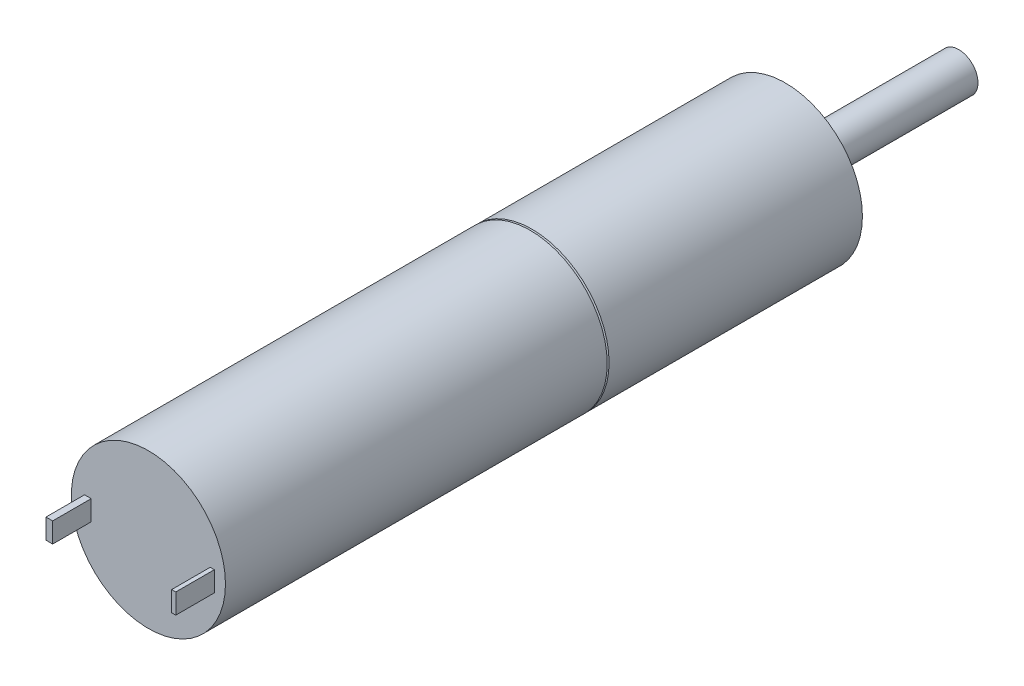
ISO-10303-21;
HEADER;
FILE_DESCRIPTION(('STEP AP214'),'2;1');
FILE_NAME('part.step','',(''),(''),'','','');
FILE_SCHEMA(('AUTOMOTIVE_DESIGN { 1 0 10303 214 1 1 1 1 }'));
ENDSEC;
DATA;
#1=APPLICATION_CONTEXT('core data for automotive mechanical design processes');
#2=APPLICATION_PROTOCOL_DEFINITION('international standard','automotive_design',2000,#1);
#3=PRODUCT_CONTEXT('',#1,'mechanical');
#4=PRODUCT('Part','Part','',(#3));
#5=PRODUCT_RELATED_PRODUCT_CATEGORY('part','',(#4));
#6=PRODUCT_DEFINITION_FORMATION('','',#4);
#7=PRODUCT_DEFINITION_CONTEXT('part definition',#1,'design');
#8=PRODUCT_DEFINITION('design','',#6,#7);
#9=PRODUCT_DEFINITION_SHAPE('','',#8);
#10=(LENGTH_UNIT() NAMED_UNIT(*) SI_UNIT(.MILLI.,.METRE.));
#11=(NAMED_UNIT(*) PLANE_ANGLE_UNIT() SI_UNIT($,.RADIAN.));
#12=(NAMED_UNIT(*) SI_UNIT($,.STERADIAN.) SOLID_ANGLE_UNIT());
#13=UNCERTAINTY_MEASURE_WITH_UNIT(LENGTH_MEASURE(1.E-05),#10,'distance_accuracy_value','');
#14=(GEOMETRIC_REPRESENTATION_CONTEXT(3) GLOBAL_UNCERTAINTY_ASSIGNED_CONTEXT((#13)) GLOBAL_UNIT_ASSIGNED_CONTEXT((#10,
#11,#12)) REPRESENTATION_CONTEXT('',''));
#15=CARTESIAN_POINT('',(0.,0.,0.));
#16=DIRECTION('',(0.,0.,1.));
#17=DIRECTION('',(1.,0.,0.));
#18=AXIS2_PLACEMENT_3D('',#15,#16,#17);
#19=CARTESIAN_POINT('',(0.,0.,-19.8));
#20=DIRECTION('',(0.,0.,1.));
#21=DIRECTION('',(1.,0.,0.));
#22=AXIS2_PLACEMENT_3D('',#19,#20,#21);
#23=CYLINDRICAL_SURFACE('',#22,6.);
#24=CARTESIAN_POINT('',(0.,0.,0.0727940468532392));
#25=DIRECTION('',(0.,0.,1.));
#26=DIRECTION('',(1.,0.,0.));
#27=AXIS2_PLACEMENT_3D('',#24,#25,#26);
#28=CIRCLE('',#27,6.);
#29=CARTESIAN_POINT('',(6.,0.,0.0727940468532392));
#30=VERTEX_POINT('',#29);
#31=EDGE_CURVE('E35',#30,#30,#28,.F.);
#32=ORIENTED_EDGE('',*,*,#31,.F.);
#33=EDGE_LOOP('',(#32));
#34=FACE_BOUND('',#33,.T.);
#35=CARTESIAN_POINT('',(0.,0.,29.8));
#36=DIRECTION('',(0.,0.,1.));
#37=DIRECTION('',(1.,0.,0.));
#38=AXIS2_PLACEMENT_3D('',#35,#36,#37);
#39=CIRCLE('',#38,6.);
#40=CARTESIAN_POINT('',(6.,0.,29.8));
#41=VERTEX_POINT('',#40);
#42=EDGE_CURVE('E155',#41,#41,#39,.T.);
#43=ORIENTED_EDGE('',*,*,#42,.F.);
#44=EDGE_LOOP('',(#43));
#45=FACE_BOUND('',#44,.T.);
#46=ADVANCED_FACE('F31',(#34,#45),#23,.T.);
#47=CARTESIAN_POINT('',(0.,0.,29.8));
#48=DIRECTION('',(0.,0.,1.));
#49=DIRECTION('',(1.,0.,0.));
#50=AXIS2_PLACEMENT_3D('',#47,#48,#49);
#51=PLANE('',#50);
#52=DIRECTION('',(1.,0.,0.));
#53=VECTOR('',#52,1.);
#54=CARTESIAN_POINT('',(4.80867690938958,-1.02837535009037,29.8));
#55=LINE('',#54,#53);
#56=CARTESIAN_POINT('',(4.80867690938958,-1.02837535009037,29.8));
#57=VERTEX_POINT('',#56);
#58=CARTESIAN_POINT('',(5.13075329447688,-1.02837535009037,29.8));
#59=VERTEX_POINT('',#58);
#60=EDGE_CURVE('E127',#57,#59,#55,.T.);
#61=ORIENTED_EDGE('',*,*,#60,.F.);
#62=DIRECTION('',(0.,-1.,0.));
#63=VECTOR('',#62,1.);
#64=CARTESIAN_POINT('',(4.80867690938958,0.535540550361091,29.8));
#65=LINE('',#64,#63);
#66=CARTESIAN_POINT('',(4.80867690938958,0.535540550361091,29.8));
#67=VERTEX_POINT('',#66);
#68=EDGE_CURVE('E124',#67,#57,#65,.T.);
#69=ORIENTED_EDGE('',*,*,#68,.F.);
#70=DIRECTION('',(-1.,0.,0.));
#71=VECTOR('',#70,1.);
#72=CARTESIAN_POINT('',(4.80867690938958,0.535540550361091,29.8));
#73=LINE('',#72,#71);
#74=CARTESIAN_POINT('',(5.13075329447688,0.535540550361091,29.8));
#75=VERTEX_POINT('',#74);
#76=EDGE_CURVE('E136',#75,#67,#73,.T.);
#77=ORIENTED_EDGE('',*,*,#76,.F.);
#78=DIRECTION('',(0.,1.,0.));
#79=VECTOR('',#78,1.);
#80=CARTESIAN_POINT('',(5.13075329447688,0.535540550361091,29.8));
#81=LINE('',#80,#79);
#82=EDGE_CURVE('E144',#59,#75,#81,.T.);
#83=ORIENTED_EDGE('',*,*,#82,.F.);
#84=EDGE_LOOP('',(#61,#69,#77,#83));
#85=FACE_BOUND('',#84,.T.);
#86=ORIENTED_EDGE('',*,*,#42,.T.);
#87=EDGE_LOOP('',(#86));
#88=FACE_BOUND('',#87,.T.);
#89=DIRECTION('',(1.,0.,0.));
#90=VECTOR('',#89,1.);
#91=CARTESIAN_POINT('',(-4.9747765863799,-1.02837535009037,29.8));
#92=LINE('',#91,#90);
#93=CARTESIAN_POINT('',(-4.9747765863799,-1.02837535009037,29.8));
#94=VERTEX_POINT('',#93);
#95=CARTESIAN_POINT('',(-4.45506110528449,-1.02837535009037,29.8));
#96=VERTEX_POINT('',#95);
#97=EDGE_CURVE('E189',#94,#96,#92,.T.);
#98=ORIENTED_EDGE('',*,*,#97,.F.);
#99=DIRECTION('',(0.,-1.,0.));
#100=VECTOR('',#99,1.);
#101=CARTESIAN_POINT('',(-4.9747765863799,0.535540550361091,29.8));
#102=LINE('',#101,#100);
#103=CARTESIAN_POINT('',(-4.9747765863799,0.535540550361091,29.8));
#104=VERTEX_POINT('',#103);
#105=EDGE_CURVE('E122',#104,#94,#102,.T.);
#106=ORIENTED_EDGE('',*,*,#105,.F.);
#107=DIRECTION('',(-1.,0.,0.));
#108=VECTOR('',#107,1.);
#109=CARTESIAN_POINT('',(-4.9747765863799,0.535540550361091,29.8));
#110=LINE('',#109,#108);
#111=CARTESIAN_POINT('',(-4.45506110528449,0.535540550361091,29.8));
#112=VERTEX_POINT('',#111);
#113=EDGE_CURVE('E118',#112,#104,#110,.T.);
#114=ORIENTED_EDGE('',*,*,#113,.F.);
#115=DIRECTION('',(0.,1.,0.));
#116=VECTOR('',#115,1.);
#117=CARTESIAN_POINT('',(-4.45506110528449,0.535540550361091,29.8));
#118=LINE('',#117,#116);
#119=EDGE_CURVE('E191',#96,#112,#118,.T.);
#120=ORIENTED_EDGE('',*,*,#119,.F.);
#121=EDGE_LOOP('',(#98,#106,#114,#120));
#122=FACE_BOUND('',#121,.T.);
#123=ADVANCED_FACE('F196',(#85,#88,#122),#51,.T.);
#124=CARTESIAN_POINT('',(4.80867690938958,0.535540550361091,32.8));
#125=DIRECTION('',(1.,0.,0.));
#126=DIRECTION('',(0.,0.,-1.));
#127=AXIS2_PLACEMENT_3D('',#124,#125,#126);
#128=PLANE('',#127);
#129=ORIENTED_EDGE('',*,*,#68,.T.);
#130=DIRECTION('',(0.,0.,-1.));
#131=VECTOR('',#130,1.);
#132=CARTESIAN_POINT('',(4.80867690938958,-1.02837535009037,32.8));
#133=LINE('',#132,#131);
#134=CARTESIAN_POINT('',(4.80867690938958,-1.02837535009037,32.8));
#135=VERTEX_POINT('',#134);
#136=EDGE_CURVE('E153',#135,#57,#133,.T.);
#137=ORIENTED_EDGE('',*,*,#136,.F.);
#138=DIRECTION('',(0.,-1.,0.));
#139=VECTOR('',#138,1.);
#140=CARTESIAN_POINT('',(4.80867690938958,0.535540550361091,32.8));
#141=LINE('',#140,#139);
#142=CARTESIAN_POINT('',(4.80867690938958,0.535540550361091,32.8));
#143=VERTEX_POINT('',#142);
#144=EDGE_CURVE('E132',#143,#135,#141,.T.);
#145=ORIENTED_EDGE('',*,*,#144,.F.);
#146=DIRECTION('',(0.,0.,-1.));
#147=VECTOR('',#146,1.);
#148=CARTESIAN_POINT('',(4.80867690938958,0.535540550361091,32.8));
#149=LINE('',#148,#147);
#150=EDGE_CURVE('E141',#143,#67,#149,.T.);
#151=ORIENTED_EDGE('',*,*,#150,.T.);
#152=EDGE_LOOP('',(#129,#137,#145,#151));
#153=FACE_BOUND('',#152,.T.);
#154=ADVANCED_FACE('F215',(#153),#128,.F.);
#155=CARTESIAN_POINT('',(4.80867690938958,-1.02837535009037,32.8));
#156=DIRECTION('',(0.,1.,0.));
#157=DIRECTION('',(0.,0.,1.));
#158=AXIS2_PLACEMENT_3D('',#155,#156,#157);
#159=PLANE('',#158);
#160=ORIENTED_EDGE('',*,*,#60,.T.);
#161=DIRECTION('',(0.,0.,-1.));
#162=VECTOR('',#161,1.);
#163=CARTESIAN_POINT('',(5.13075329447688,-1.02837535009037,32.8));
#164=LINE('',#163,#162);
#165=CARTESIAN_POINT('',(5.13075329447688,-1.02837535009037,32.8));
#166=VERTEX_POINT('',#165);
#167=EDGE_CURVE('E150',#166,#59,#164,.T.);
#168=ORIENTED_EDGE('',*,*,#167,.F.);
#169=DIRECTION('',(1.,0.,0.));
#170=VECTOR('',#169,1.);
#171=CARTESIAN_POINT('',(4.80867690938958,-1.02837535009037,32.8));
#172=LINE('',#171,#170);
#173=EDGE_CURVE('E135',#135,#166,#172,.T.);
#174=ORIENTED_EDGE('',*,*,#173,.F.);
#175=ORIENTED_EDGE('',*,*,#136,.T.);
#176=EDGE_LOOP('',(#160,#168,#174,#175));
#177=FACE_BOUND('',#176,.T.);
#178=ADVANCED_FACE('F379',(#177),#159,.F.);
#179=CARTESIAN_POINT('',(5.13075329447688,0.535540550361091,32.8));
#180=DIRECTION('',(-1.,0.,0.));
#181=DIRECTION('',(0.,0.,1.));
#182=AXIS2_PLACEMENT_3D('',#179,#180,#181);
#183=PLANE('',#182);
#184=ORIENTED_EDGE('',*,*,#82,.T.);
#185=DIRECTION('',(0.,0.,-1.));
#186=VECTOR('',#185,1.);
#187=CARTESIAN_POINT('',(5.13075329447688,0.535540550361091,32.8));
#188=LINE('',#187,#186);
#189=CARTESIAN_POINT('',(5.13075329447688,0.535540550361091,32.8));
#190=VERTEX_POINT('',#189);
#191=EDGE_CURVE('E56',#190,#75,#188,.T.);
#192=ORIENTED_EDGE('',*,*,#191,.F.);
#193=DIRECTION('',(0.,1.,0.));
#194=VECTOR('',#193,1.);
#195=CARTESIAN_POINT('',(5.13075329447688,0.535540550361091,32.8));
#196=LINE('',#195,#194);
#197=EDGE_CURVE('E138',#166,#190,#196,.T.);
#198=ORIENTED_EDGE('',*,*,#197,.F.);
#199=ORIENTED_EDGE('',*,*,#167,.T.);
#200=EDGE_LOOP('',(#184,#192,#198,#199));
#201=FACE_BOUND('',#200,.T.);
#202=ADVANCED_FACE('F370',(#201),#183,.F.);
#203=CARTESIAN_POINT('',(4.80867690938958,0.535540550361091,32.8));
#204=DIRECTION('',(0.,-1.,0.));
#205=DIRECTION('',(0.,0.,-1.));
#206=AXIS2_PLACEMENT_3D('',#203,#204,#205);
#207=PLANE('',#206);
#208=ORIENTED_EDGE('',*,*,#76,.T.);
#209=ORIENTED_EDGE('',*,*,#150,.F.);
#210=DIRECTION('',(-1.,0.,0.));
#211=VECTOR('',#210,1.);
#212=CARTESIAN_POINT('',(4.80867690938958,0.535540550361091,32.8));
#213=LINE('',#212,#211);
#214=EDGE_CURVE('E140',#190,#143,#213,.T.);
#215=ORIENTED_EDGE('',*,*,#214,.F.);
#216=ORIENTED_EDGE('',*,*,#191,.T.);
#217=EDGE_LOOP('',(#208,#209,#215,#216));
#218=FACE_BOUND('',#217,.T.);
#219=ADVANCED_FACE('F360',(#218),#207,.F.);
#220=CARTESIAN_POINT('',(4.80867690938958,-1.02837535009037,32.8));
#221=DIRECTION('',(0.,0.,1.));
#222=DIRECTION('',(1.,0.,0.));
#223=AXIS2_PLACEMENT_3D('',#220,#221,#222);
#224=PLANE('',#223);
#225=ORIENTED_EDGE('',*,*,#144,.T.);
#226=ORIENTED_EDGE('',*,*,#173,.T.);
#227=ORIENTED_EDGE('',*,*,#197,.T.);
#228=ORIENTED_EDGE('',*,*,#214,.T.);
#229=EDGE_LOOP('',(#225,#226,#227,#228));
#230=FACE_BOUND('',#229,.T.);
#231=ADVANCED_FACE('F351',(#230),#224,.T.);
#232=CARTESIAN_POINT('',(-4.9747765863799,0.535540550361091,32.8));
#233=DIRECTION('',(1.,0.,0.));
#234=DIRECTION('',(0.,0.,-1.));
#235=AXIS2_PLACEMENT_3D('',#232,#233,#234);
#236=PLANE('',#235);
#237=ORIENTED_EDGE('',*,*,#105,.T.);
#238=DIRECTION('',(0.,0.,-1.));
#239=VECTOR('',#238,1.);
#240=CARTESIAN_POINT('',(-4.9747765863799,-1.02837535009037,32.8));
#241=LINE('',#240,#239);
#242=CARTESIAN_POINT('',(-4.9747765863799,-1.02837535009037,32.8));
#243=VERTEX_POINT('',#242);
#244=EDGE_CURVE('E103',#243,#94,#241,.T.);
#245=ORIENTED_EDGE('',*,*,#244,.F.);
#246=DIRECTION('',(0.,-1.,0.));
#247=VECTOR('',#246,1.);
#248=CARTESIAN_POINT('',(-4.9747765863799,0.535540550361091,32.8));
#249=LINE('',#248,#247);
#250=CARTESIAN_POINT('',(-4.9747765863799,0.535540550361091,32.8));
#251=VERTEX_POINT('',#250);
#252=EDGE_CURVE('E110',#251,#243,#249,.T.);
#253=ORIENTED_EDGE('',*,*,#252,.F.);
#254=DIRECTION('',(0.,0.,-1.));
#255=VECTOR('',#254,1.);
#256=CARTESIAN_POINT('',(-4.9747765863799,0.535540550361091,32.8));
#257=LINE('',#256,#255);
#258=EDGE_CURVE('E187',#251,#104,#257,.T.);
#259=ORIENTED_EDGE('',*,*,#258,.T.);
#260=EDGE_LOOP('',(#237,#245,#253,#259));
#261=FACE_BOUND('',#260,.T.);
#262=ADVANCED_FACE('F120',(#261),#236,.F.);
#263=CARTESIAN_POINT('',(-4.9747765863799,-1.02837535009037,32.8));
#264=DIRECTION('',(0.,1.,0.));
#265=DIRECTION('',(0.,0.,1.));
#266=AXIS2_PLACEMENT_3D('',#263,#264,#265);
#267=PLANE('',#266);
#268=ORIENTED_EDGE('',*,*,#97,.T.);
#269=DIRECTION('',(0.,0.,-1.));
#270=VECTOR('',#269,1.);
#271=CARTESIAN_POINT('',(-4.45506110528449,-1.02837535009037,32.8));
#272=LINE('',#271,#270);
#273=CARTESIAN_POINT('',(-4.45506110528449,-1.02837535009037,32.8));
#274=VERTEX_POINT('',#273);
#275=EDGE_CURVE('E106',#274,#96,#272,.T.);
#276=ORIENTED_EDGE('',*,*,#275,.F.);
#277=DIRECTION('',(1.,0.,0.));
#278=VECTOR('',#277,1.);
#279=CARTESIAN_POINT('',(-4.9747765863799,-1.02837535009037,32.8));
#280=LINE('',#279,#278);
#281=EDGE_CURVE('E99',#243,#274,#280,.T.);
#282=ORIENTED_EDGE('',*,*,#281,.F.);
#283=ORIENTED_EDGE('',*,*,#244,.T.);
#284=EDGE_LOOP('',(#268,#276,#282,#283));
#285=FACE_BOUND('',#284,.T.);
#286=ADVANCED_FACE('F101',(#285),#267,.F.);
#287=CARTESIAN_POINT('',(-4.45506110528449,0.535540550361091,32.8));
#288=DIRECTION('',(-1.,0.,0.));
#289=DIRECTION('',(0.,0.,1.));
#290=AXIS2_PLACEMENT_3D('',#287,#288,#289);
#291=PLANE('',#290);
#292=ORIENTED_EDGE('',*,*,#119,.T.);
#293=DIRECTION('',(0.,0.,-1.));
#294=VECTOR('',#293,1.);
#295=CARTESIAN_POINT('',(-4.45506110528449,0.535540550361091,32.8));
#296=LINE('',#295,#294);
#297=CARTESIAN_POINT('',(-4.45506110528449,0.535540550361091,32.8));
#298=VERTEX_POINT('',#297);
#299=EDGE_CURVE('E48',#298,#112,#296,.T.);
#300=ORIENTED_EDGE('',*,*,#299,.F.);
#301=DIRECTION('',(0.,1.,0.));
#302=VECTOR('',#301,1.);
#303=CARTESIAN_POINT('',(-4.45506110528449,0.535540550361091,32.8));
#304=LINE('',#303,#302);
#305=EDGE_CURVE('E109',#274,#298,#304,.T.);
#306=ORIENTED_EDGE('',*,*,#305,.F.);
#307=ORIENTED_EDGE('',*,*,#275,.T.);
#308=EDGE_LOOP('',(#292,#300,#306,#307));
#309=FACE_BOUND('',#308,.T.);
#310=ADVANCED_FACE('F199',(#309),#291,.F.);
#311=CARTESIAN_POINT('',(-4.9747765863799,0.535540550361091,32.8));
#312=DIRECTION('',(0.,-1.,0.));
#313=DIRECTION('',(0.,0.,-1.));
#314=AXIS2_PLACEMENT_3D('',#311,#312,#313);
#315=PLANE('',#314);
#316=ORIENTED_EDGE('',*,*,#113,.T.);
#317=ORIENTED_EDGE('',*,*,#258,.F.);
#318=DIRECTION('',(-1.,0.,0.));
#319=VECTOR('',#318,1.);
#320=CARTESIAN_POINT('',(-4.9747765863799,0.535540550361091,32.8));
#321=LINE('',#320,#319);
#322=EDGE_CURVE('E114',#298,#251,#321,.T.);
#323=ORIENTED_EDGE('',*,*,#322,.F.);
#324=ORIENTED_EDGE('',*,*,#299,.T.);
#325=EDGE_LOOP('',(#316,#317,#323,#324));
#326=FACE_BOUND('',#325,.T.);
#327=ADVANCED_FACE('F200',(#326),#315,.F.);
#328=CARTESIAN_POINT('',(-4.9747765863799,-1.02837535009037,32.8));
#329=DIRECTION('',(0.,0.,1.));
#330=DIRECTION('',(1.,0.,0.));
#331=AXIS2_PLACEMENT_3D('',#328,#329,#330);
#332=PLANE('',#331);
#333=ORIENTED_EDGE('',*,*,#252,.T.);
#334=ORIENTED_EDGE('',*,*,#281,.T.);
#335=ORIENTED_EDGE('',*,*,#305,.T.);
#336=ORIENTED_EDGE('',*,*,#322,.T.);
#337=EDGE_LOOP('',(#333,#334,#335,#336));
#338=FACE_BOUND('',#337,.T.);
#339=ADVANCED_FACE('F113',(#338),#332,.T.);
#340=CARTESIAN_POINT('',(0.,0.,0.714830227866669));
#341=DIRECTION('',(0.,0.,1.));
#342=DIRECTION('',(1.,0.,0.));
#343=AXIS2_PLACEMENT_3D('',#340,#341,#342);
#344=CONICAL_SURFACE('',#343,7.76397990980731,1.22173047639604);
#345=ORIENTED_EDGE('',*,*,#31,.T.);
#346=EDGE_LOOP('',(#345));
#347=FACE_BOUND('',#346,.T.);
#348=CARTESIAN_POINT('',(0.,0.,0.));
#349=DIRECTION('',(0.,0.,-1.));
#350=DIRECTION('',(-1.,0.,0.));
#351=AXIS2_PLACEMENT_3D('',#348,#349,#350);
#352=CIRCLE('',#351,5.8);
#353=CARTESIAN_POINT('',(-5.8,0.,0.));
#354=VERTEX_POINT('',#353);
#355=EDGE_CURVE('E161',#354,#354,#352,.T.);
#356=ORIENTED_EDGE('',*,*,#355,.F.);
#357=EDGE_LOOP('',(#356));
#358=FACE_BOUND('',#357,.T.);
#359=ADVANCED_FACE('F207',(#347,#358),#344,.T.);
#360=CARTESIAN_POINT('',(0.,0.,0.));
#361=DIRECTION('',(0.,0.,-1.));
#362=DIRECTION('',(-1.,0.,0.));
#363=AXIS2_PLACEMENT_3D('',#360,#361,#362);
#364=CONICAL_SURFACE('',#363,5.8,1.22173047639603);
#365=CARTESIAN_POINT('',(0.,0.,-0.0727940468532405));
#366=DIRECTION('',(0.,0.,-1.));
#367=DIRECTION('',(-1.,0.,0.));
#368=AXIS2_PLACEMENT_3D('',#365,#366,#367);
#369=CIRCLE('',#368,6.);
#370=CARTESIAN_POINT('',(-6.,0.,-0.0727940468532405));
#371=VERTEX_POINT('',#370);
#372=EDGE_CURVE('E159',#371,#371,#369,.F.);
#373=ORIENTED_EDGE('',*,*,#372,.T.);
#374=EDGE_LOOP('',(#373));
#375=FACE_BOUND('',#374,.T.);
#376=ORIENTED_EDGE('',*,*,#355,.T.);
#377=EDGE_LOOP('',(#376));
#378=FACE_BOUND('',#377,.T.);
#379=ADVANCED_FACE('F253',(#375,#378),#364,.T.);
#380=CARTESIAN_POINT('',(0.,0.,-33.3));
#381=DIRECTION('',(0.,0.,-1.));
#382=DIRECTION('',(-1.,0.,0.));
#383=AXIS2_PLACEMENT_3D('',#380,#381,#382);
#384=PLANE('',#383);
#385=CARTESIAN_POINT('',(0.,0.,-33.3));
#386=DIRECTION('',(0.,0.,-1.));
#387=DIRECTION('',(-1.,0.,0.));
#388=AXIS2_PLACEMENT_3D('',#385,#386,#387);
#389=CIRCLE('',#388,1.5);
#390=CARTESIAN_POINT('',(-1.5,0.,-33.3));
#391=VERTEX_POINT('',#390);
#392=EDGE_CURVE('E180',#391,#391,#389,.T.);
#393=ORIENTED_EDGE('',*,*,#392,.T.);
#394=EDGE_LOOP('',(#393));
#395=FACE_BOUND('',#394,.T.);
#396=ADVANCED_FACE('F251',(#395),#384,.T.);
#397=CARTESIAN_POINT('',(-4.75,0.,-6.3));
#398=DIRECTION('',(0.,0.,-1.));
#399=DIRECTION('',(-1.,0.,0.));
#400=AXIS2_PLACEMENT_3D('',#397,#398,#399);
#401=PLANE('',#400);
#402=CARTESIAN_POINT('',(-4.75,0.,-6.3));
#403=DIRECTION('',(0.,0.,-1.));
#404=DIRECTION('',(-1.,0.,0.));
#405=AXIS2_PLACEMENT_3D('',#402,#403,#404);
#406=CIRCLE('',#405,1.);
#407=CARTESIAN_POINT('',(-5.75,0.,-6.3));
#408=VERTEX_POINT('',#407);
#409=EDGE_CURVE('E177',#408,#408,#406,.T.);
#410=ORIENTED_EDGE('',*,*,#409,.T.);
#411=EDGE_LOOP('',(#410));
#412=FACE_BOUND('',#411,.T.);
#413=ADVANCED_FACE('F246',(#412),#401,.T.);
#414=CARTESIAN_POINT('',(4.75,0.,-6.3));
#415=DIRECTION('',(0.,0.,-1.));
#416=DIRECTION('',(-1.,0.,0.));
#417=AXIS2_PLACEMENT_3D('',#414,#415,#416);
#418=PLANE('',#417);
#419=CARTESIAN_POINT('',(4.75,0.,-6.3));
#420=DIRECTION('',(0.,0.,-1.));
#421=DIRECTION('',(-1.,0.,0.));
#422=AXIS2_PLACEMENT_3D('',#419,#420,#421);
#423=CIRCLE('',#422,1.);
#424=CARTESIAN_POINT('',(3.75,0.,-6.3));
#425=VERTEX_POINT('',#424);
#426=EDGE_CURVE('E171',#425,#425,#423,.T.);
#427=ORIENTED_EDGE('',*,*,#426,.T.);
#428=EDGE_LOOP('',(#427));
#429=FACE_BOUND('',#428,.T.);
#430=ADVANCED_FACE('F237',(#429),#418,.T.);
#431=CARTESIAN_POINT('',(0.,0.,-33.3));
#432=DIRECTION('',(0.,0.,1.));
#433=DIRECTION('',(1.,0.,0.));
#434=AXIS2_PLACEMENT_3D('',#431,#432,#433);
#435=CYLINDRICAL_SURFACE('',#434,1.5);
#436=ORIENTED_EDGE('',*,*,#392,.F.);
#437=EDGE_LOOP('',(#436));
#438=FACE_BOUND('',#437,.T.);
#439=CARTESIAN_POINT('',(0.,0.,-19.8));
#440=DIRECTION('',(0.,0.,1.));
#441=DIRECTION('',(1.,0.,0.));
#442=AXIS2_PLACEMENT_3D('',#439,#440,#441);
#443=CIRCLE('',#442,1.5);
#444=CARTESIAN_POINT('',(1.5,0.,-19.8));
#445=VERTEX_POINT('',#444);
#446=EDGE_CURVE('E11',#445,#445,#443,.F.);
#447=ORIENTED_EDGE('',*,*,#446,.T.);
#448=EDGE_LOOP('',(#447));
#449=FACE_BOUND('',#448,.T.);
#450=ADVANCED_FACE('F234',(#438,#449),#435,.T.);
#451=CARTESIAN_POINT('',(-4.75,0.,-6.3));
#452=DIRECTION('',(0.,0.,-1.));
#453=DIRECTION('',(-1.,0.,0.));
#454=AXIS2_PLACEMENT_3D('',#451,#452,#453);
#455=CYLINDRICAL_SURFACE('',#454,1.);
#456=ORIENTED_EDGE('',*,*,#409,.F.);
#457=EDGE_LOOP('',(#456));
#458=FACE_BOUND('',#457,.T.);
#459=CARTESIAN_POINT('',(-4.75,0.,-19.8));
#460=DIRECTION('',(0.,0.,-1.));
#461=DIRECTION('',(-1.,0.,0.));
#462=AXIS2_PLACEMENT_3D('',#459,#460,#461);
#463=CIRCLE('',#462,1.);
#464=CARTESIAN_POINT('',(-5.75,0.,-19.8));
#465=VERTEX_POINT('',#464);
#466=EDGE_CURVE('E174',#465,#465,#463,.T.);
#467=ORIENTED_EDGE('',*,*,#466,.T.);
#468=EDGE_LOOP('',(#467));
#469=FACE_BOUND('',#468,.T.);
#470=ADVANCED_FACE('F236',(#458,#469),#455,.F.);
#471=CARTESIAN_POINT('',(4.75,0.,-6.3));
#472=DIRECTION('',(0.,0.,-1.));
#473=DIRECTION('',(-1.,0.,0.));
#474=AXIS2_PLACEMENT_3D('',#471,#472,#473);
#475=CYLINDRICAL_SURFACE('',#474,1.);
#476=ORIENTED_EDGE('',*,*,#426,.F.);
#477=EDGE_LOOP('',(#476));
#478=FACE_BOUND('',#477,.T.);
#479=CARTESIAN_POINT('',(4.75,0.,-19.8));
#480=DIRECTION('',(0.,0.,-1.));
#481=DIRECTION('',(-1.,0.,0.));
#482=AXIS2_PLACEMENT_3D('',#479,#480,#481);
#483=CIRCLE('',#482,1.);
#484=CARTESIAN_POINT('',(3.75,0.,-19.8));
#485=VERTEX_POINT('',#484);
#486=EDGE_CURVE('E165',#485,#485,#483,.T.);
#487=ORIENTED_EDGE('',*,*,#486,.T.);
#488=EDGE_LOOP('',(#487));
#489=FACE_BOUND('',#488,.T.);
#490=ADVANCED_FACE('F226',(#478,#489),#475,.F.);
#491=CARTESIAN_POINT('',(0.,0.,-19.8));
#492=DIRECTION('',(0.,0.,1.));
#493=DIRECTION('',(1.,0.,0.));
#494=AXIS2_PLACEMENT_3D('',#491,#492,#493);
#495=PLANE('',#494);
#496=ORIENTED_EDGE('',*,*,#486,.F.);
#497=EDGE_LOOP('',(#496));
#498=FACE_BOUND('',#497,.T.);
#499=ORIENTED_EDGE('',*,*,#466,.F.);
#500=EDGE_LOOP('',(#499));
#501=FACE_BOUND('',#500,.T.);
#502=CARTESIAN_POINT('',(0.,0.,-19.8));
#503=DIRECTION('',(0.,0.,1.));
#504=DIRECTION('',(1.,0.,0.));
#505=AXIS2_PLACEMENT_3D('',#502,#503,#504);
#506=CIRCLE('',#505,6.);
#507=CARTESIAN_POINT('',(6.,0.,-19.8));
#508=VERTEX_POINT('',#507);
#509=EDGE_CURVE('E40',#508,#508,#506,.T.);
#510=ORIENTED_EDGE('',*,*,#509,.F.);
#511=EDGE_LOOP('',(#510));
#512=FACE_BOUND('',#511,.T.);
#513=ORIENTED_EDGE('',*,*,#446,.F.);
#514=EDGE_LOOP('',(#513));
#515=FACE_BOUND('',#514,.T.);
#516=ADVANCED_FACE('F221',(#498,#501,#512,#515),#495,.F.);
#517=ORIENTED_EDGE('',*,*,#372,.F.);
#518=EDGE_LOOP('',(#517));
#519=FACE_BOUND('',#518,.T.);
#520=ORIENTED_EDGE('',*,*,#509,.T.);
#521=EDGE_LOOP('',(#520));
#522=FACE_BOUND('',#521,.T.);
#523=ADVANCED_FACE('F33',(#519,#522),#23,.T.);
#524=CLOSED_SHELL('',(#46,#123,#154,#178,#202,#219,#231,#262,#286,#310,#327,#339,#359,#379,#396,
#413,#430,#450,#470,#490,#516,#523));
#525=MANIFOLD_SOLID_BREP('B2',#524);
#526=ADVANCED_BREP_SHAPE_REPRESENTATION('',(#18,#525),#14);
#527=SHAPE_DEFINITION_REPRESENTATION(#9,#526);
ENDSEC;
END-ISO-10303-21;
